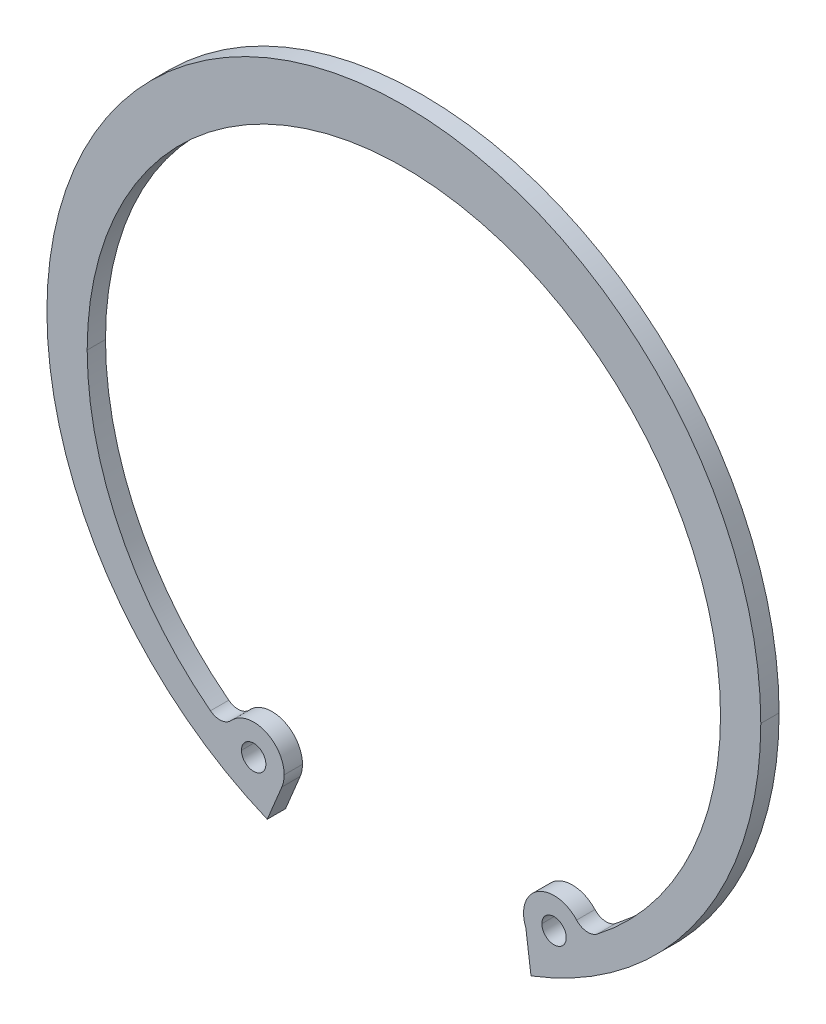
ISO-10303-21;
HEADER;
FILE_DESCRIPTION(('STEP AP214'),'2;1');
FILE_NAME('part.step','',(''),(''),'','','');
FILE_SCHEMA(('AUTOMOTIVE_DESIGN { 1 0 10303 214 1 1 1 1 }'));
ENDSEC;
DATA;
#1=APPLICATION_CONTEXT('core data for automotive mechanical design processes');
#2=APPLICATION_PROTOCOL_DEFINITION('international standard','automotive_design',2000,#1);
#3=PRODUCT_CONTEXT('',#1,'mechanical');
#4=PRODUCT('Part','Part','',(#3));
#5=PRODUCT_RELATED_PRODUCT_CATEGORY('part','',(#4));
#6=PRODUCT_DEFINITION_FORMATION('','',#4);
#7=PRODUCT_DEFINITION_CONTEXT('part definition',#1,'design');
#8=PRODUCT_DEFINITION('design','',#6,#7);
#9=PRODUCT_DEFINITION_SHAPE('','',#8);
#10=(LENGTH_UNIT() NAMED_UNIT(*) SI_UNIT(.MILLI.,.METRE.));
#11=(NAMED_UNIT(*) PLANE_ANGLE_UNIT() SI_UNIT($,.RADIAN.));
#12=(NAMED_UNIT(*) SI_UNIT($,.STERADIAN.) SOLID_ANGLE_UNIT());
#13=UNCERTAINTY_MEASURE_WITH_UNIT(LENGTH_MEASURE(1.E-05),#10,'distance_accuracy_value','');
#14=(GEOMETRIC_REPRESENTATION_CONTEXT(3) GLOBAL_UNCERTAINTY_ASSIGNED_CONTEXT((#13)) GLOBAL_UNIT_ASSIGNED_CONTEXT((#10,
#11,#12)) REPRESENTATION_CONTEXT('',''));
#15=CARTESIAN_POINT('',(0.,0.,0.));
#16=DIRECTION('',(0.,0.,1.));
#17=DIRECTION('',(1.,0.,0.));
#18=AXIS2_PLACEMENT_3D('',#15,#16,#17);
#19=CARTESIAN_POINT('',(-19.9952093410759,-48.2727055737147,-3.));
#20=DIRECTION('',(0.923879532511287,-0.382683432365091,0.));
#21=DIRECTION('',(0.,0.,-1.));
#22=AXIS2_PLACEMENT_3D('',#19,#20,#21);
#23=PLANE('',#22);
#24=DIRECTION('',(0.382683432365091,0.923879532511287,0.));
#25=VECTOR('',#24,1.);
#26=CARTESIAN_POINT('',(-19.9952093410759,-48.2727055737147,0.));
#27=LINE('',#26,#25);
#28=CARTESIAN_POINT('',(-22.3869807933578,-54.0469526519103,0.));
#29=VERTEX_POINT('',#28);
#30=CARTESIAN_POINT('',(-19.9952093410759,-48.2727055737147,0.));
#31=VERTEX_POINT('',#30);
#32=EDGE_CURVE('E43',#29,#31,#27,.T.);
#33=ORIENTED_EDGE('',*,*,#32,.F.);
#34=DIRECTION('',(0.,0.,1.));
#35=VECTOR('',#34,1.);
#36=CARTESIAN_POINT('',(-22.3869807933578,-54.0469526519103,-3.));
#37=LINE('',#36,#35);
#38=CARTESIAN_POINT('',(-22.3869807933578,-54.0469526519103,-3.));
#39=VERTEX_POINT('',#38);
#40=EDGE_CURVE('E258',#39,#29,#37,.T.);
#41=ORIENTED_EDGE('',*,*,#40,.F.);
#42=DIRECTION('',(0.382683432365091,0.923879532511287,0.));
#43=VECTOR('',#42,1.);
#44=CARTESIAN_POINT('',(-19.9952093410759,-48.2727055737147,-3.));
#45=LINE('',#44,#43);
#46=CARTESIAN_POINT('',(-19.9952093410759,-48.2727055737147,-3.));
#47=VERTEX_POINT('',#46);
#48=EDGE_CURVE('E11',#39,#47,#45,.T.);
#49=ORIENTED_EDGE('',*,*,#48,.T.);
#50=DIRECTION('',(0.,0.,1.));
#51=VECTOR('',#50,1.);
#52=CARTESIAN_POINT('',(-19.9952093410759,-48.2727055737147,-3.));
#53=LINE('',#52,#51);
#54=EDGE_CURVE('E28',#47,#31,#53,.T.);
#55=ORIENTED_EDGE('',*,*,#54,.T.);
#56=EDGE_LOOP('',(#33,#41,#49,#55));
#57=FACE_BOUND('',#56,.T.);
#58=ADVANCED_FACE('F17',(#57),#23,.T.);
#59=CARTESIAN_POINT('',(-24.6146070036324,-46.3592884118893,-3.));
#60=DIRECTION('',(0.,0.,1.));
#61=DIRECTION('',(1.,0.,0.));
#62=AXIS2_PLACEMENT_3D('',#59,#60,#61);
#63=CYLINDRICAL_SURFACE('',#62,5.);
#64=CARTESIAN_POINT('',(-24.6146070036324,-46.3592884118893,-3.));
#65=DIRECTION('',(0.,0.,1.));
#66=DIRECTION('',(1.,0.,0.));
#67=AXIS2_PLACEMENT_3D('',#64,#65,#66);
#68=CIRCLE('',#67,5.);
#69=CARTESIAN_POINT('',(-19.6146070036324,-46.3592884118893,-3.));
#70=VERTEX_POINT('',#69);
#71=EDGE_CURVE('E227',#47,#70,#68,.T.);
#72=ORIENTED_EDGE('',*,*,#71,.T.);
#73=DIRECTION('',(0.,0.,1.));
#74=VECTOR('',#73,1.);
#75=CARTESIAN_POINT('',(-19.6146070036324,-46.3592884118893,-3.));
#76=LINE('',#75,#74);
#77=CARTESIAN_POINT('',(-19.6146070036324,-46.3592884118893,0.));
#78=VERTEX_POINT('',#77);
#79=EDGE_CURVE('E232',#70,#78,#76,.T.);
#80=ORIENTED_EDGE('',*,*,#79,.T.);
#81=CARTESIAN_POINT('',(-24.6146070036324,-46.3592884118893,0.));
#82=DIRECTION('',(0.,0.,1.));
#83=DIRECTION('',(1.,0.,0.));
#84=AXIS2_PLACEMENT_3D('',#81,#82,#83);
#85=CIRCLE('',#84,5.);
#86=EDGE_CURVE('E200',#31,#78,#85,.T.);
#87=ORIENTED_EDGE('',*,*,#86,.F.);
#88=ORIENTED_EDGE('',*,*,#54,.F.);
#89=EDGE_LOOP('',(#72,#80,#87,#88));
#90=FACE_BOUND('',#89,.T.);
#91=ADVANCED_FACE('F440',(#90),#63,.T.);
#92=CARTESIAN_POINT('',(0.,0.,-3.));
#93=DIRECTION('',(0.,0.,1.));
#94=DIRECTION('',(1.,0.,0.));
#95=AXIS2_PLACEMENT_3D('',#92,#93,#94);
#96=CYLINDRICAL_SURFACE('',#95,58.5);
#97=DIRECTION('',(0.,0.,1.));
#98=VECTOR('',#97,1.);
#99=CARTESIAN_POINT('',(-58.5,0.,-3.));
#100=LINE('',#99,#98);
#101=CARTESIAN_POINT('',(-58.5,0.,-3.));
#102=VERTEX_POINT('',#101);
#103=CARTESIAN_POINT('',(-58.5,0.,0.));
#104=VERTEX_POINT('',#103);
#105=EDGE_CURVE('E302',#102,#104,#100,.T.);
#106=ORIENTED_EDGE('',*,*,#105,.F.);
#107=CARTESIAN_POINT('',(0.,0.,-3.));
#108=DIRECTION('',(0.,0.,1.));
#109=DIRECTION('',(1.,0.,0.));
#110=AXIS2_PLACEMENT_3D('',#107,#108,#109);
#111=CIRCLE('',#110,58.5);
#112=EDGE_CURVE('E271',#102,#39,#111,.T.);
#113=ORIENTED_EDGE('',*,*,#112,.T.);
#114=ORIENTED_EDGE('',*,*,#40,.T.);
#115=CARTESIAN_POINT('',(0.,0.,0.));
#116=DIRECTION('',(0.,0.,1.));
#117=DIRECTION('',(1.,0.,0.));
#118=AXIS2_PLACEMENT_3D('',#115,#116,#117);
#119=CIRCLE('',#118,58.5);
#120=EDGE_CURVE('E206',#104,#29,#119,.T.);
#121=ORIENTED_EDGE('',*,*,#120,.F.);
#122=EDGE_LOOP('',(#106,#113,#114,#121));
#123=FACE_BOUND('',#122,.T.);
#124=ADVANCED_FACE('F311',(#123),#96,.T.);
#125=CARTESIAN_POINT('',(0.,0.,-3.));
#126=DIRECTION('',(0.,0.,1.));
#127=DIRECTION('',(1.,0.,0.));
#128=AXIS2_PLACEMENT_3D('',#125,#126,#127);
#129=PLANE('',#128);
#130=CARTESIAN_POINT('',(0.,0.,-3.));
#131=DIRECTION('',(0.,0.,1.));
#132=DIRECTION('',(1.,0.,0.));
#133=AXIS2_PLACEMENT_3D('',#130,#131,#132);
#134=CIRCLE('',#133,58.5);
#135=CARTESIAN_POINT('',(20.8365607493471,-54.663403993337,-3.));
#136=VERTEX_POINT('',#135);
#137=CARTESIAN_POINT('',(58.5,0.,-3.));
#138=VERTEX_POINT('',#137);
#139=EDGE_CURVE('E207',#136,#138,#134,.T.);
#140=ORIENTED_EDGE('',*,*,#139,.F.);
#141=DIRECTION('',(0.130526192220052,-0.99144486137381,0.));
#142=VECTOR('',#141,1.);
#143=CARTESIAN_POINT('',(19.995209341076,-48.2727055737147,-3.));
#144=LINE('',#143,#142);
#145=CARTESIAN_POINT('',(19.995209341076,-48.2727055737147,-3.));
#146=VERTEX_POINT('',#145);
#147=EDGE_CURVE('E192',#146,#136,#144,.T.);
#148=ORIENTED_EDGE('',*,*,#147,.F.);
#149=CARTESIAN_POINT('',(24.6146070036324,-46.3592884118893,-3.));
#150=DIRECTION('',(0.,0.,1.));
#151=DIRECTION('',(-1.,0.,0.));
#152=AXIS2_PLACEMENT_3D('',#149,#150,#151);
#153=CIRCLE('',#152,5.);
#154=CARTESIAN_POINT('',(28.316854871264,-42.9987288265497,-3.));
#155=VERTEX_POINT('',#154);
#156=EDGE_CURVE('E21',#155,#146,#153,.T.);
#157=ORIENTED_EDGE('',*,*,#156,.F.);
#158=CARTESIAN_POINT('',(30.1679788050797,-41.3184490338799,-3.));
#159=DIRECTION('',(0.,0.,-1.));
#160=DIRECTION('',(-1.,0.,0.));
#161=AXIS2_PLACEMENT_3D('',#158,#159,#160);
#162=CIRCLE('',#161,2.5);
#163=CARTESIAN_POINT('',(31.6946983802356,-43.2981276287119,-3.));
#164=VERTEX_POINT('',#163);
#165=EDGE_CURVE('E193',#164,#155,#162,.T.);
#166=ORIENTED_EDGE('',*,*,#165,.F.);
#167=CARTESIAN_POINT('',(0.,-2.2,-3.));
#168=DIRECTION('',(0.,0.,-1.));
#169=DIRECTION('',(1.,0.,0.));
#170=AXIS2_PLACEMENT_3D('',#167,#168,#169);
#171=CIRCLE('',#170,51.9);
#172=CARTESIAN_POINT('',(51.9,-2.2,-3.));
#173=VERTEX_POINT('',#172);
#174=EDGE_CURVE('E220',#173,#164,#171,.T.);
#175=ORIENTED_EDGE('',*,*,#174,.F.);
#176=CARTESIAN_POINT('',(0.,-2.2,-3.));
#177=DIRECTION('',(0.,0.,-1.));
#178=DIRECTION('',(1.,0.,0.));
#179=AXIS2_PLACEMENT_3D('',#176,#177,#178);
#180=CIRCLE('',#179,51.9);
#181=CARTESIAN_POINT('',(-51.9,-2.2,-3.));
#182=VERTEX_POINT('',#181);
#183=EDGE_CURVE('E151',#182,#173,#180,.T.);
#184=ORIENTED_EDGE('',*,*,#183,.F.);
#185=CARTESIAN_POINT('',(0.,-2.2,-3.));
#186=DIRECTION('',(0.,0.,-1.));
#187=DIRECTION('',(1.,0.,0.));
#188=AXIS2_PLACEMENT_3D('',#185,#186,#187);
#189=CIRCLE('',#188,51.9);
#190=CARTESIAN_POINT('',(-31.6946983802356,-43.2981276287119,-3.));
#191=VERTEX_POINT('',#190);
#192=EDGE_CURVE('E142',#191,#182,#189,.T.);
#193=ORIENTED_EDGE('',*,*,#192,.F.);
#194=CARTESIAN_POINT('',(-30.1679788050797,-41.3184490338799,-3.));
#195=DIRECTION('',(0.,0.,-1.));
#196=DIRECTION('',(1.,0.,0.));
#197=AXIS2_PLACEMENT_3D('',#194,#195,#196);
#198=CIRCLE('',#197,2.5);
#199=CARTESIAN_POINT('',(-28.3168548712639,-42.9987288265497,-3.));
#200=VERTEX_POINT('',#199);
#201=EDGE_CURVE('E148',#200,#191,#198,.T.);
#202=ORIENTED_EDGE('',*,*,#201,.F.);
#203=CARTESIAN_POINT('',(-24.6146070036324,-46.3592884118893,-3.));
#204=DIRECTION('',(0.,0.,1.));
#205=DIRECTION('',(1.,0.,0.));
#206=AXIS2_PLACEMENT_3D('',#203,#204,#205);
#207=CIRCLE('',#206,5.);
#208=EDGE_CURVE('E275',#70,#200,#207,.T.);
#209=ORIENTED_EDGE('',*,*,#208,.F.);
#210=ORIENTED_EDGE('',*,*,#71,.F.);
#211=ORIENTED_EDGE('',*,*,#48,.F.);
#212=ORIENTED_EDGE('',*,*,#112,.F.);
#213=CARTESIAN_POINT('',(0.,0.,-3.));
#214=DIRECTION('',(0.,0.,1.));
#215=DIRECTION('',(1.,0.,0.));
#216=AXIS2_PLACEMENT_3D('',#213,#214,#215);
#217=CIRCLE('',#216,58.5);
#218=EDGE_CURVE('E304',#138,#102,#217,.T.);
#219=ORIENTED_EDGE('',*,*,#218,.F.);
#220=EDGE_LOOP('',(#140,#148,#157,#166,#175,#184,#193,#202,#209,#210,#211,#212,#219));
#221=FACE_BOUND('',#220,.T.);
#222=CARTESIAN_POINT('',(24.6146070036324,-46.3592884118893,-3.));
#223=DIRECTION('',(0.,0.,1.));
#224=DIRECTION('',(-1.,0.,0.));
#225=AXIS2_PLACEMENT_3D('',#222,#223,#224);
#226=CIRCLE('',#225,2.);
#227=CARTESIAN_POINT('',(26.6146070036324,-46.3592884118893,-3.));
#228=VERTEX_POINT('',#227);
#229=CARTESIAN_POINT('',(22.6146070036324,-46.3592884118893,-3.));
#230=VERTEX_POINT('',#229);
#231=EDGE_CURVE('E254',#228,#230,#226,.T.);
#232=ORIENTED_EDGE('',*,*,#231,.T.);
#233=CARTESIAN_POINT('',(24.6146070036324,-46.3592884118893,-3.));
#234=DIRECTION('',(0.,0.,1.));
#235=DIRECTION('',(-1.,0.,0.));
#236=AXIS2_PLACEMENT_3D('',#233,#234,#235);
#237=CIRCLE('',#236,2.);
#238=EDGE_CURVE('E186',#230,#228,#237,.T.);
#239=ORIENTED_EDGE('',*,*,#238,.T.);
#240=EDGE_LOOP('',(#232,#239));
#241=FACE_BOUND('',#240,.T.);
#242=CARTESIAN_POINT('',(-24.6146070036324,-46.3592884118893,-3.));
#243=DIRECTION('',(0.,0.,1.));
#244=DIRECTION('',(1.,0.,0.));
#245=AXIS2_PLACEMENT_3D('',#242,#243,#244);
#246=CIRCLE('',#245,2.);
#247=CARTESIAN_POINT('',(-22.6146070036324,-46.3592884118893,-3.));
#248=VERTEX_POINT('',#247);
#249=CARTESIAN_POINT('',(-26.6146070036324,-46.3592884118893,-3.));
#250=VERTEX_POINT('',#249);
#251=EDGE_CURVE('E183',#248,#250,#246,.T.);
#252=ORIENTED_EDGE('',*,*,#251,.T.);
#253=CARTESIAN_POINT('',(-24.6146070036324,-46.3592884118893,-3.));
#254=DIRECTION('',(0.,0.,1.));
#255=DIRECTION('',(1.,0.,0.));
#256=AXIS2_PLACEMENT_3D('',#253,#254,#255);
#257=CIRCLE('',#256,2.);
#258=EDGE_CURVE('E187',#250,#248,#257,.T.);
#259=ORIENTED_EDGE('',*,*,#258,.T.);
#260=EDGE_LOOP('',(#252,#259));
#261=FACE_BOUND('',#260,.T.);
#262=ADVANCED_FACE('F145',(#221,#241,#261),#129,.F.);
#263=CARTESIAN_POINT('',(0.,0.,0.));
#264=DIRECTION('',(0.,0.,1.));
#265=DIRECTION('',(1.,0.,0.));
#266=AXIS2_PLACEMENT_3D('',#263,#264,#265);
#267=PLANE('',#266);
#268=CARTESIAN_POINT('',(0.,0.,0.));
#269=DIRECTION('',(0.,0.,1.));
#270=DIRECTION('',(1.,0.,0.));
#271=AXIS2_PLACEMENT_3D('',#268,#269,#270);
#272=CIRCLE('',#271,58.5);
#273=CARTESIAN_POINT('',(20.8365607493471,-54.663403993337,0.));
#274=VERTEX_POINT('',#273);
#275=CARTESIAN_POINT('',(58.5,0.,0.));
#276=VERTEX_POINT('',#275);
#277=EDGE_CURVE('E236',#274,#276,#272,.T.);
#278=ORIENTED_EDGE('',*,*,#277,.T.);
#279=CARTESIAN_POINT('',(0.,0.,0.));
#280=DIRECTION('',(0.,0.,1.));
#281=DIRECTION('',(1.,0.,0.));
#282=AXIS2_PLACEMENT_3D('',#279,#280,#281);
#283=CIRCLE('',#282,58.5);
#284=EDGE_CURVE('E240',#276,#104,#283,.T.);
#285=ORIENTED_EDGE('',*,*,#284,.T.);
#286=ORIENTED_EDGE('',*,*,#120,.T.);
#287=ORIENTED_EDGE('',*,*,#32,.T.);
#288=ORIENTED_EDGE('',*,*,#86,.T.);
#289=CARTESIAN_POINT('',(-24.6146070036324,-46.3592884118893,0.));
#290=DIRECTION('',(0.,0.,1.));
#291=DIRECTION('',(1.,0.,0.));
#292=AXIS2_PLACEMENT_3D('',#289,#290,#291);
#293=CIRCLE('',#292,5.);
#294=CARTESIAN_POINT('',(-28.3168548712639,-42.9987288265497,0.));
#295=VERTEX_POINT('',#294);
#296=EDGE_CURVE('E203',#78,#295,#293,.T.);
#297=ORIENTED_EDGE('',*,*,#296,.T.);
#298=CARTESIAN_POINT('',(-30.1679788050797,-41.3184490338799,0.));
#299=DIRECTION('',(0.,0.,-1.));
#300=DIRECTION('',(1.,0.,0.));
#301=AXIS2_PLACEMENT_3D('',#298,#299,#300);
#302=CIRCLE('',#301,2.5);
#303=CARTESIAN_POINT('',(-31.6946983802356,-43.2981276287119,0.));
#304=VERTEX_POINT('',#303);
#305=EDGE_CURVE('E215',#295,#304,#302,.T.);
#306=ORIENTED_EDGE('',*,*,#305,.T.);
#307=CARTESIAN_POINT('',(0.,-2.2,0.));
#308=DIRECTION('',(0.,0.,-1.));
#309=DIRECTION('',(1.,0.,0.));
#310=AXIS2_PLACEMENT_3D('',#307,#308,#309);
#311=CIRCLE('',#310,51.9);
#312=CARTESIAN_POINT('',(-51.9,-2.2,0.));
#313=VERTEX_POINT('',#312);
#314=EDGE_CURVE('E171',#304,#313,#311,.T.);
#315=ORIENTED_EDGE('',*,*,#314,.T.);
#316=CARTESIAN_POINT('',(0.,-2.2,0.));
#317=DIRECTION('',(0.,0.,-1.));
#318=DIRECTION('',(1.,0.,0.));
#319=AXIS2_PLACEMENT_3D('',#316,#317,#318);
#320=CIRCLE('',#319,51.9);
#321=CARTESIAN_POINT('',(51.9,-2.2,0.));
#322=VERTEX_POINT('',#321);
#323=EDGE_CURVE('E198',#313,#322,#320,.T.);
#324=ORIENTED_EDGE('',*,*,#323,.T.);
#325=CARTESIAN_POINT('',(0.,-2.2,0.));
#326=DIRECTION('',(0.,0.,-1.));
#327=DIRECTION('',(1.,0.,0.));
#328=AXIS2_PLACEMENT_3D('',#325,#326,#327);
#329=CIRCLE('',#328,51.9);
#330=CARTESIAN_POINT('',(31.6946983802356,-43.2981276287119,0.));
#331=VERTEX_POINT('',#330);
#332=EDGE_CURVE('E194',#322,#331,#329,.T.);
#333=ORIENTED_EDGE('',*,*,#332,.T.);
#334=CARTESIAN_POINT('',(30.1679788050797,-41.3184490338799,0.));
#335=DIRECTION('',(0.,0.,-1.));
#336=DIRECTION('',(-1.,0.,0.));
#337=AXIS2_PLACEMENT_3D('',#334,#335,#336);
#338=CIRCLE('',#337,2.5);
#339=CARTESIAN_POINT('',(28.316854871264,-42.9987288265497,0.));
#340=VERTEX_POINT('',#339);
#341=EDGE_CURVE('E199',#331,#340,#338,.T.);
#342=ORIENTED_EDGE('',*,*,#341,.T.);
#343=CARTESIAN_POINT('',(24.6146070036324,-46.3592884118893,0.));
#344=DIRECTION('',(0.,0.,1.));
#345=DIRECTION('',(-1.,0.,0.));
#346=AXIS2_PLACEMENT_3D('',#343,#344,#345);
#347=CIRCLE('',#346,5.);
#348=CARTESIAN_POINT('',(19.995209341076,-48.2727055737147,0.));
#349=VERTEX_POINT('',#348);
#350=EDGE_CURVE('E274',#340,#349,#347,.T.);
#351=ORIENTED_EDGE('',*,*,#350,.T.);
#352=DIRECTION('',(0.130526192220052,-0.99144486137381,0.));
#353=VECTOR('',#352,1.);
#354=CARTESIAN_POINT('',(19.995209341076,-48.2727055737147,0.));
#355=LINE('',#354,#353);
#356=EDGE_CURVE('E272',#349,#274,#355,.T.);
#357=ORIENTED_EDGE('',*,*,#356,.T.);
#358=EDGE_LOOP('',(#278,#285,#286,#287,#288,#297,#306,#315,#324,#333,#342,#351,#357));
#359=FACE_BOUND('',#358,.T.);
#360=CARTESIAN_POINT('',(24.6146070036324,-46.3592884118893,0.));
#361=DIRECTION('',(0.,0.,1.));
#362=DIRECTION('',(-1.,0.,0.));
#363=AXIS2_PLACEMENT_3D('',#360,#361,#362);
#364=CIRCLE('',#363,2.);
#365=CARTESIAN_POINT('',(26.6146070036324,-46.3592884118893,0.));
#366=VERTEX_POINT('',#365);
#367=CARTESIAN_POINT('',(22.6146070036324,-46.3592884118893,0.));
#368=VERTEX_POINT('',#367);
#369=EDGE_CURVE('E167',#366,#368,#364,.T.);
#370=ORIENTED_EDGE('',*,*,#369,.F.);
#371=CARTESIAN_POINT('',(24.6146070036324,-46.3592884118893,0.));
#372=DIRECTION('',(0.,0.,1.));
#373=DIRECTION('',(-1.,0.,0.));
#374=AXIS2_PLACEMENT_3D('',#371,#372,#373);
#375=CIRCLE('',#374,2.);
#376=EDGE_CURVE('E323',#368,#366,#375,.T.);
#377=ORIENTED_EDGE('',*,*,#376,.F.);
#378=EDGE_LOOP('',(#370,#377));
#379=FACE_BOUND('',#378,.T.);
#380=CARTESIAN_POINT('',(-24.6146070036324,-46.3592884118893,0.));
#381=DIRECTION('',(0.,0.,1.));
#382=DIRECTION('',(1.,0.,0.));
#383=AXIS2_PLACEMENT_3D('',#380,#381,#382);
#384=CIRCLE('',#383,2.);
#385=CARTESIAN_POINT('',(-22.6146070036324,-46.3592884118893,0.));
#386=VERTEX_POINT('',#385);
#387=CARTESIAN_POINT('',(-26.6146070036324,-46.3592884118893,0.));
#388=VERTEX_POINT('',#387);
#389=EDGE_CURVE('E221',#386,#388,#384,.T.);
#390=ORIENTED_EDGE('',*,*,#389,.F.);
#391=CARTESIAN_POINT('',(-24.6146070036324,-46.3592884118893,0.));
#392=DIRECTION('',(0.,0.,1.));
#393=DIRECTION('',(1.,0.,0.));
#394=AXIS2_PLACEMENT_3D('',#391,#392,#393);
#395=CIRCLE('',#394,2.);
#396=EDGE_CURVE('E262',#388,#386,#395,.T.);
#397=ORIENTED_EDGE('',*,*,#396,.F.);
#398=EDGE_LOOP('',(#390,#397));
#399=FACE_BOUND('',#398,.T.);
#400=ADVANCED_FACE('F19',(#359,#379,#399),#267,.T.);
#401=CARTESIAN_POINT('',(-24.6146070036324,-46.3592884118893,-3.));
#402=DIRECTION('',(0.,0.,1.));
#403=DIRECTION('',(1.,0.,0.));
#404=AXIS2_PLACEMENT_3D('',#401,#402,#403);
#405=CYLINDRICAL_SURFACE('',#404,5.);
#406=ORIENTED_EDGE('',*,*,#79,.F.);
#407=ORIENTED_EDGE('',*,*,#208,.T.);
#408=DIRECTION('',(0.,0.,1.));
#409=VECTOR('',#408,1.);
#410=CARTESIAN_POINT('',(-28.3168548712639,-42.9987288265497,-3.));
#411=LINE('',#410,#409);
#412=EDGE_CURVE('E165',#200,#295,#411,.T.);
#413=ORIENTED_EDGE('',*,*,#412,.T.);
#414=ORIENTED_EDGE('',*,*,#296,.F.);
#415=EDGE_LOOP('',(#406,#407,#413,#414));
#416=FACE_BOUND('',#415,.T.);
#417=ADVANCED_FACE('F435',(#416),#405,.T.);
#418=CARTESIAN_POINT('',(0.,0.,-3.));
#419=DIRECTION('',(0.,0.,1.));
#420=DIRECTION('',(1.,0.,0.));
#421=AXIS2_PLACEMENT_3D('',#418,#419,#420);
#422=CYLINDRICAL_SURFACE('',#421,58.5);
#423=ORIENTED_EDGE('',*,*,#218,.T.);
#424=ORIENTED_EDGE('',*,*,#105,.T.);
#425=ORIENTED_EDGE('',*,*,#284,.F.);
#426=DIRECTION('',(0.,0.,1.));
#427=VECTOR('',#426,1.);
#428=CARTESIAN_POINT('',(58.5,0.,-3.));
#429=LINE('',#428,#427);
#430=EDGE_CURVE('E211',#138,#276,#429,.T.);
#431=ORIENTED_EDGE('',*,*,#430,.F.);
#432=EDGE_LOOP('',(#423,#424,#425,#431));
#433=FACE_BOUND('',#432,.T.);
#434=ADVANCED_FACE('F301',(#433),#422,.T.);
#435=CARTESIAN_POINT('',(24.6146070036324,-46.3592884118893,-3.));
#436=DIRECTION('',(0.,0.,1.));
#437=DIRECTION('',(1.,0.,0.));
#438=AXIS2_PLACEMENT_3D('',#435,#436,#437);
#439=CYLINDRICAL_SURFACE('',#438,2.);
#440=ORIENTED_EDGE('',*,*,#238,.F.);
#441=DIRECTION('',(0.,0.,1.));
#442=VECTOR('',#441,1.);
#443=CARTESIAN_POINT('',(22.6146070036324,-46.3592884118893,-3.));
#444=LINE('',#443,#442);
#445=EDGE_CURVE('E309',#230,#368,#444,.T.);
#446=ORIENTED_EDGE('',*,*,#445,.T.);
#447=ORIENTED_EDGE('',*,*,#376,.T.);
#448=DIRECTION('',(0.,0.,1.));
#449=VECTOR('',#448,1.);
#450=CARTESIAN_POINT('',(26.6146070036324,-46.3592884118893,-3.));
#451=LINE('',#450,#449);
#452=EDGE_CURVE('E181',#228,#366,#451,.T.);
#453=ORIENTED_EDGE('',*,*,#452,.F.);
#454=EDGE_LOOP('',(#440,#446,#447,#453));
#455=FACE_BOUND('',#454,.T.);
#456=ADVANCED_FACE('F426',(#455),#439,.F.);
#457=CARTESIAN_POINT('',(24.6146070036324,-46.3592884118893,-3.));
#458=DIRECTION('',(0.,0.,1.));
#459=DIRECTION('',(1.,0.,0.));
#460=AXIS2_PLACEMENT_3D('',#457,#458,#459);
#461=CYLINDRICAL_SURFACE('',#460,2.);
#462=ORIENTED_EDGE('',*,*,#445,.F.);
#463=ORIENTED_EDGE('',*,*,#231,.F.);
#464=ORIENTED_EDGE('',*,*,#452,.T.);
#465=ORIENTED_EDGE('',*,*,#369,.T.);
#466=EDGE_LOOP('',(#462,#463,#464,#465));
#467=FACE_BOUND('',#466,.T.);
#468=ADVANCED_FACE('F425',(#467),#461,.F.);
#469=CARTESIAN_POINT('',(-30.1679788050797,-41.3184490338799,-3.));
#470=DIRECTION('',(0.,0.,1.));
#471=DIRECTION('',(1.,0.,0.));
#472=AXIS2_PLACEMENT_3D('',#469,#470,#471);
#473=CYLINDRICAL_SURFACE('',#472,2.5);
#474=ORIENTED_EDGE('',*,*,#305,.F.);
#475=ORIENTED_EDGE('',*,*,#412,.F.);
#476=ORIENTED_EDGE('',*,*,#201,.T.);
#477=DIRECTION('',(0.,0.,1.));
#478=VECTOR('',#477,1.);
#479=CARTESIAN_POINT('',(-31.6946983802356,-43.2981276287119,-3.));
#480=LINE('',#479,#478);
#481=EDGE_CURVE('E157',#191,#304,#480,.T.);
#482=ORIENTED_EDGE('',*,*,#481,.T.);
#483=EDGE_LOOP('',(#474,#475,#476,#482));
#484=FACE_BOUND('',#483,.T.);
#485=ADVANCED_FACE('F163',(#484),#473,.F.);
#486=CARTESIAN_POINT('',(0.,-2.2,-3.));
#487=DIRECTION('',(0.,0.,1.));
#488=DIRECTION('',(1.,0.,0.));
#489=AXIS2_PLACEMENT_3D('',#486,#487,#488);
#490=CYLINDRICAL_SURFACE('',#489,51.9);
#491=ORIENTED_EDGE('',*,*,#192,.T.);
#492=DIRECTION('',(0.,0.,1.));
#493=VECTOR('',#492,1.);
#494=CARTESIAN_POINT('',(-51.9,-2.2,-3.));
#495=LINE('',#494,#493);
#496=EDGE_CURVE('E158',#182,#313,#495,.T.);
#497=ORIENTED_EDGE('',*,*,#496,.T.);
#498=ORIENTED_EDGE('',*,*,#314,.F.);
#499=ORIENTED_EDGE('',*,*,#481,.F.);
#500=EDGE_LOOP('',(#491,#497,#498,#499));
#501=FACE_BOUND('',#500,.T.);
#502=ADVANCED_FACE('F169',(#501),#490,.F.);
#503=CARTESIAN_POINT('',(24.6146070036324,-46.3592884118893,-3.));
#504=DIRECTION('',(0.,0.,1.));
#505=DIRECTION('',(1.,0.,0.));
#506=AXIS2_PLACEMENT_3D('',#503,#504,#505);
#507=CYLINDRICAL_SURFACE('',#506,5.);
#508=ORIENTED_EDGE('',*,*,#350,.F.);
#509=DIRECTION('',(0.,0.,1.));
#510=VECTOR('',#509,1.);
#511=CARTESIAN_POINT('',(28.316854871264,-42.9987288265497,-3.));
#512=LINE('',#511,#510);
#513=EDGE_CURVE('E253',#155,#340,#512,.T.);
#514=ORIENTED_EDGE('',*,*,#513,.F.);
#515=ORIENTED_EDGE('',*,*,#156,.T.);
#516=DIRECTION('',(0.,0.,1.));
#517=VECTOR('',#516,1.);
#518=CARTESIAN_POINT('',(19.995209341076,-48.2727055737147,-3.));
#519=LINE('',#518,#517);
#520=EDGE_CURVE('E210',#146,#349,#519,.T.);
#521=ORIENTED_EDGE('',*,*,#520,.T.);
#522=EDGE_LOOP('',(#508,#514,#515,#521));
#523=FACE_BOUND('',#522,.T.);
#524=ADVANCED_FACE('F349',(#523),#507,.T.);
#525=CARTESIAN_POINT('',(0.,0.,-3.));
#526=DIRECTION('',(0.,0.,1.));
#527=DIRECTION('',(1.,0.,0.));
#528=AXIS2_PLACEMENT_3D('',#525,#526,#527);
#529=CYLINDRICAL_SURFACE('',#528,58.5);
#530=ORIENTED_EDGE('',*,*,#139,.T.);
#531=ORIENTED_EDGE('',*,*,#430,.T.);
#532=ORIENTED_EDGE('',*,*,#277,.F.);
#533=DIRECTION('',(0.,0.,1.));
#534=VECTOR('',#533,1.);
#535=CARTESIAN_POINT('',(20.8365607493471,-54.663403993337,-3.));
#536=LINE('',#535,#534);
#537=EDGE_CURVE('E188',#136,#274,#536,.T.);
#538=ORIENTED_EDGE('',*,*,#537,.F.);
#539=EDGE_LOOP('',(#530,#531,#532,#538));
#540=FACE_BOUND('',#539,.T.);
#541=ADVANCED_FACE('F355',(#540),#529,.T.);
#542=CARTESIAN_POINT('',(0.,-2.2,-3.));
#543=DIRECTION('',(0.,0.,1.));
#544=DIRECTION('',(1.,0.,0.));
#545=AXIS2_PLACEMENT_3D('',#542,#543,#544);
#546=CYLINDRICAL_SURFACE('',#545,51.9);
#547=DIRECTION('',(0.,0.,1.));
#548=VECTOR('',#547,1.);
#549=CARTESIAN_POINT('',(51.9,-2.2,-3.));
#550=LINE('',#549,#548);
#551=EDGE_CURVE('E335',#173,#322,#550,.T.);
#552=ORIENTED_EDGE('',*,*,#551,.F.);
#553=ORIENTED_EDGE('',*,*,#174,.T.);
#554=DIRECTION('',(0.,0.,1.));
#555=VECTOR('',#554,1.);
#556=CARTESIAN_POINT('',(31.6946983802356,-43.2981276287119,-3.));
#557=LINE('',#556,#555);
#558=EDGE_CURVE('E216',#164,#331,#557,.T.);
#559=ORIENTED_EDGE('',*,*,#558,.T.);
#560=ORIENTED_EDGE('',*,*,#332,.F.);
#561=EDGE_LOOP('',(#552,#553,#559,#560));
#562=FACE_BOUND('',#561,.T.);
#563=ADVANCED_FACE('F461',(#562),#546,.F.);
#564=CARTESIAN_POINT('',(0.,-2.2,-3.));
#565=DIRECTION('',(0.,0.,1.));
#566=DIRECTION('',(1.,0.,0.));
#567=AXIS2_PLACEMENT_3D('',#564,#565,#566);
#568=CYLINDRICAL_SURFACE('',#567,51.9);
#569=ORIENTED_EDGE('',*,*,#496,.F.);
#570=ORIENTED_EDGE('',*,*,#183,.T.);
#571=ORIENTED_EDGE('',*,*,#551,.T.);
#572=ORIENTED_EDGE('',*,*,#323,.F.);
#573=EDGE_LOOP('',(#569,#570,#571,#572));
#574=FACE_BOUND('',#573,.T.);
#575=ADVANCED_FACE('F453',(#574),#568,.F.);
#576=CARTESIAN_POINT('',(-24.6146070036324,-46.3592884118893,-3.));
#577=DIRECTION('',(0.,0.,1.));
#578=DIRECTION('',(1.,0.,0.));
#579=AXIS2_PLACEMENT_3D('',#576,#577,#578);
#580=CYLINDRICAL_SURFACE('',#579,2.);
#581=ORIENTED_EDGE('',*,*,#258,.F.);
#582=DIRECTION('',(0.,0.,1.));
#583=VECTOR('',#582,1.);
#584=CARTESIAN_POINT('',(-26.6146070036324,-46.3592884118893,-3.));
#585=LINE('',#584,#583);
#586=EDGE_CURVE('E283',#250,#388,#585,.T.);
#587=ORIENTED_EDGE('',*,*,#586,.T.);
#588=ORIENTED_EDGE('',*,*,#396,.T.);
#589=DIRECTION('',(0.,0.,1.));
#590=VECTOR('',#589,1.);
#591=CARTESIAN_POINT('',(-22.6146070036324,-46.3592884118893,-3.));
#592=LINE('',#591,#590);
#593=EDGE_CURVE('E225',#248,#386,#592,.T.);
#594=ORIENTED_EDGE('',*,*,#593,.F.);
#595=EDGE_LOOP('',(#581,#587,#588,#594));
#596=FACE_BOUND('',#595,.T.);
#597=ADVANCED_FACE('F451',(#596),#580,.F.);
#598=CARTESIAN_POINT('',(-24.6146070036324,-46.3592884118893,-3.));
#599=DIRECTION('',(0.,0.,1.));
#600=DIRECTION('',(1.,0.,0.));
#601=AXIS2_PLACEMENT_3D('',#598,#599,#600);
#602=CYLINDRICAL_SURFACE('',#601,2.);
#603=ORIENTED_EDGE('',*,*,#586,.F.);
#604=ORIENTED_EDGE('',*,*,#251,.F.);
#605=ORIENTED_EDGE('',*,*,#593,.T.);
#606=ORIENTED_EDGE('',*,*,#389,.T.);
#607=EDGE_LOOP('',(#603,#604,#605,#606));
#608=FACE_BOUND('',#607,.T.);
#609=ADVANCED_FACE('F450',(#608),#602,.F.);
#610=CARTESIAN_POINT('',(19.995209341076,-48.2727055737147,-3.));
#611=DIRECTION('',(-0.99144486137381,-0.130526192220052,0.));
#612=DIRECTION('',(-0.130526192220052,0.99144486137381,0.));
#613=AXIS2_PLACEMENT_3D('',#610,#611,#612);
#614=PLANE('',#613);
#615=ORIENTED_EDGE('',*,*,#356,.F.);
#616=ORIENTED_EDGE('',*,*,#520,.F.);
#617=ORIENTED_EDGE('',*,*,#147,.T.);
#618=ORIENTED_EDGE('',*,*,#537,.T.);
#619=EDGE_LOOP('',(#615,#616,#617,#618));
#620=FACE_BOUND('',#619,.T.);
#621=ADVANCED_FACE('F352',(#620),#614,.T.);
#622=CARTESIAN_POINT('',(30.1679788050797,-41.3184490338799,-3.));
#623=DIRECTION('',(0.,0.,1.));
#624=DIRECTION('',(1.,0.,0.));
#625=AXIS2_PLACEMENT_3D('',#622,#623,#624);
#626=CYLINDRICAL_SURFACE('',#625,2.5);
#627=ORIENTED_EDGE('',*,*,#341,.F.);
#628=ORIENTED_EDGE('',*,*,#558,.F.);
#629=ORIENTED_EDGE('',*,*,#165,.T.);
#630=ORIENTED_EDGE('',*,*,#513,.T.);
#631=EDGE_LOOP('',(#627,#628,#629,#630));
#632=FACE_BOUND('',#631,.T.);
#633=ADVANCED_FACE('F395',(#632),#626,.F.);
#634=CLOSED_SHELL('',(#58,#91,#124,#262,#400,#417,#434,#456,#468,#485,#502,#524,#541,#563,#575,
#597,#609,#621,#633));
#635=MANIFOLD_SOLID_BREP('B1',#634);
#636=ADVANCED_BREP_SHAPE_REPRESENTATION('',(#18,#635),#14);
#637=SHAPE_DEFINITION_REPRESENTATION(#9,#636);
ENDSEC;
END-ISO-10303-21;
